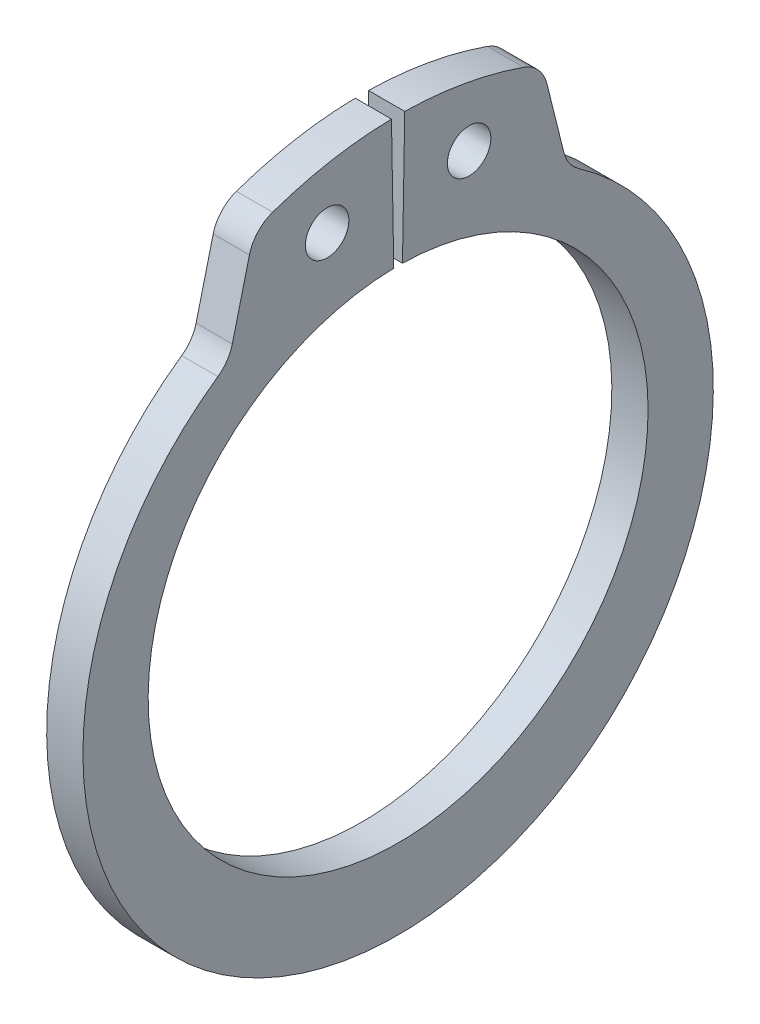
ISO-10303-21;
HEADER;
FILE_DESCRIPTION(('STEP AP214'),'2;1');
FILE_NAME('part.step','',(''),(''),'','','');
FILE_SCHEMA(('AUTOMOTIVE_DESIGN { 1 0 10303 214 1 1 1 1 }'));
ENDSEC;
DATA;
#1=APPLICATION_CONTEXT('core data for automotive mechanical design processes');
#2=APPLICATION_PROTOCOL_DEFINITION('international standard','automotive_design',2000,#1);
#3=PRODUCT_CONTEXT('',#1,'mechanical');
#4=PRODUCT('Part','Part','',(#3));
#5=PRODUCT_RELATED_PRODUCT_CATEGORY('part','',(#4));
#6=PRODUCT_DEFINITION_FORMATION('','',#4);
#7=PRODUCT_DEFINITION_CONTEXT('part definition',#1,'design');
#8=PRODUCT_DEFINITION('design','',#6,#7);
#9=PRODUCT_DEFINITION_SHAPE('','',#8);
#10=(LENGTH_UNIT() NAMED_UNIT(*) SI_UNIT(.MILLI.,.METRE.));
#11=(NAMED_UNIT(*) PLANE_ANGLE_UNIT() SI_UNIT($,.RADIAN.));
#12=(NAMED_UNIT(*) SI_UNIT($,.STERADIAN.) SOLID_ANGLE_UNIT());
#13=UNCERTAINTY_MEASURE_WITH_UNIT(LENGTH_MEASURE(1.E-05),#10,'distance_accuracy_value','');
#14=(GEOMETRIC_REPRESENTATION_CONTEXT(3) GLOBAL_UNCERTAINTY_ASSIGNED_CONTEXT((#13)) GLOBAL_UNIT_ASSIGNED_CONTEXT((#10,
#11,#12)) REPRESENTATION_CONTEXT('',''));
#15=CARTESIAN_POINT('',(0.,0.,0.));
#16=DIRECTION('',(0.,0.,1.));
#17=DIRECTION('',(1.,0.,0.));
#18=AXIS2_PLACEMENT_3D('',#15,#16,#17);
#19=CARTESIAN_POINT('',(0.5,0.,0.));
#20=DIRECTION('',(1.,0.,0.));
#21=DIRECTION('',(0.,0.,-1.));
#22=AXIS2_PLACEMENT_3D('',#19,#20,#21);
#23=PLANE('',#22);
#24=CARTESIAN_POINT('',(0.5,8.66711980549086,-1.9596288316201));
#25=DIRECTION('',(-1.,0.,0.));
#26=DIRECTION('',(0.,0.,1.));
#27=AXIS2_PLACEMENT_3D('',#24,#25,#26);
#28=CIRCLE('',#27,0.6);
#29=CARTESIAN_POINT('',(0.5,8.66711980549086,-1.3596288316201));
#30=VERTEX_POINT('',#29);
#31=EDGE_CURVE('E141',#30,#30,#28,.T.);
#32=ORIENTED_EDGE('',*,*,#31,.T.);
#33=EDGE_LOOP('',(#32));
#34=FACE_BOUND('',#33,.T.);
#35=CARTESIAN_POINT('',(0.5,0.,0.));
#36=DIRECTION('',(-1.,0.,0.));
#37=DIRECTION('',(0.,0.,1.));
#38=AXIS2_PLACEMENT_3D('',#35,#36,#37);
#39=CIRCLE('',#38,6.9);
#40=CARTESIAN_POINT('',(0.5,6.8989490965791,-0.120421604417256));
#41=VERTEX_POINT('',#40);
#42=CARTESIAN_POINT('',(0.5,6.8989490965791,0.120421604417256));
#43=VERTEX_POINT('',#42);
#44=EDGE_CURVE('E217',#41,#43,#39,.T.);
#45=ORIENTED_EDGE('',*,*,#44,.T.);
#46=DIRECTION('',(0.,-0.999847695156391,-0.0174524064372835));
#47=VECTOR('',#46,1.);
#48=CARTESIAN_POINT('',(0.5,6.8989490965791,0.120421604417256));
#49=LINE('',#48,#47);
#50=CARTESIAN_POINT('',(0.5,10.4984007991421,0.183250267591477));
#51=VERTEX_POINT('',#50);
#52=EDGE_CURVE('E157',#43,#51,#49,.F.);
#53=ORIENTED_EDGE('',*,*,#52,.T.);
#54=CARTESIAN_POINT('',(0.5,0.,0.));
#55=DIRECTION('',(-1.,0.,0.));
#56=DIRECTION('',(0.,0.,1.));
#57=AXIS2_PLACEMENT_3D('',#54,#55,#56);
#58=CIRCLE('',#57,10.5);
#59=CARTESIAN_POINT('',(0.5,9.91217887924345,3.46391539531209));
#60=VERTEX_POINT('',#59);
#61=EDGE_CURVE('E161',#60,#51,#58,.T.);
#62=ORIENTED_EDGE('',*,*,#61,.F.);
#63=CARTESIAN_POINT('',(0.5,8.96816184312502,3.13401869099666));
#64=DIRECTION('',(-1.,0.,0.));
#65=DIRECTION('',(0.,0.,1.));
#66=AXIS2_PLACEMENT_3D('',#63,#64,#65);
#67=CIRCLE('',#66,1.);
#68=CARTESIAN_POINT('',(0.5,9.21008373872469,4.10431441727265));
#69=VERTEX_POINT('',#68);
#70=EDGE_CURVE('E145',#69,#60,#67,.T.);
#71=ORIENTED_EDGE('',*,*,#70,.F.);
#72=DIRECTION('',(0.,0.970295726275997,-0.241921895599665));
#73=VECTOR('',#72,1.);
#74=CARTESIAN_POINT('',(0.5,9.71734472745919,3.97784004803122));
#75=LINE('',#74,#73);
#76=CARTESIAN_POINT('',(0.5,7.31761530924591,4.57615979123836));
#77=VERTEX_POINT('',#76);
#78=EDGE_CURVE('E139',#69,#77,#75,.F.);
#79=ORIENTED_EDGE('',*,*,#78,.T.);
#80=CARTESIAN_POINT('',(0.5,7.55953720484558,5.54645551751436));
#81=DIRECTION('',(-1.,0.,0.));
#82=DIRECTION('',(0.,0.,1.));
#83=AXIS2_PLACEMENT_3D('',#80,#81,#82);
#84=CIRCLE('',#83,1.);
#85=CARTESIAN_POINT('',(0.5,6.73911195964233,4.97470170945253));
#86=VERTEX_POINT('',#85);
#87=EDGE_CURVE('E129',#77,#86,#84,.T.);
#88=ORIENTED_EDGE('',*,*,#87,.T.);
#89=CARTESIAN_POINT('',(0.5,-0.399224177769538,0.));
#90=DIRECTION('',(-1.,0.,0.));
#91=DIRECTION('',(0.,0.,1.));
#92=AXIS2_PLACEMENT_3D('',#89,#90,#91);
#93=CIRCLE('',#92,8.70077582223046);
#94=CARTESIAN_POINT('',(0.5,6.73911195964233,-4.97470170945253));
#95=VERTEX_POINT('',#94);
#96=EDGE_CURVE('E231',#95,#86,#93,.T.);
#97=ORIENTED_EDGE('',*,*,#96,.F.);
#98=CARTESIAN_POINT('',(0.5,7.55953720484558,-5.54645551751436));
#99=DIRECTION('',(-1.,0.,0.));
#100=DIRECTION('',(0.,0.,1.));
#101=AXIS2_PLACEMENT_3D('',#98,#99,#100);
#102=CIRCLE('',#101,1.);
#103=CARTESIAN_POINT('',(0.5,7.31761530924591,-4.57615979123836));
#104=VERTEX_POINT('',#103);
#105=EDGE_CURVE('E227',#95,#104,#102,.T.);
#106=ORIENTED_EDGE('',*,*,#105,.T.);
#107=DIRECTION('',(0.,-0.970295726275997,-0.241921895599666));
#108=VECTOR('',#107,1.);
#109=CARTESIAN_POINT('',(0.5,9.71734472745919,-3.97784004803122));
#110=LINE('',#109,#108);
#111=CARTESIAN_POINT('',(0.5,9.21008373872469,-4.10431441727265));
#112=VERTEX_POINT('',#111);
#113=EDGE_CURVE('E169',#104,#112,#110,.F.);
#114=ORIENTED_EDGE('',*,*,#113,.T.);
#115=CARTESIAN_POINT('',(0.5,8.96816184312502,-3.13401869099666));
#116=DIRECTION('',(-1.,0.,0.));
#117=DIRECTION('',(0.,0.,1.));
#118=AXIS2_PLACEMENT_3D('',#115,#116,#117);
#119=CIRCLE('',#118,1.);
#120=CARTESIAN_POINT('',(0.5,9.91217887924345,-3.46391539531209));
#121=VERTEX_POINT('',#120);
#122=EDGE_CURVE('E172',#121,#112,#119,.T.);
#123=ORIENTED_EDGE('',*,*,#122,.F.);
#124=CARTESIAN_POINT('',(0.5,0.,0.));
#125=DIRECTION('',(-1.,0.,0.));
#126=DIRECTION('',(0.,0.,1.));
#127=AXIS2_PLACEMENT_3D('',#124,#125,#126);
#128=CIRCLE('',#127,10.5);
#129=CARTESIAN_POINT('',(0.5,10.4984007991421,-0.183250267591479));
#130=VERTEX_POINT('',#129);
#131=EDGE_CURVE('E220',#130,#121,#128,.T.);
#132=ORIENTED_EDGE('',*,*,#131,.F.);
#133=DIRECTION('',(0.,0.999847695156391,-0.0174524064372841));
#134=VECTOR('',#133,1.);
#135=CARTESIAN_POINT('',(0.5,10.4984007991421,-0.183250267591479));
#136=LINE('',#135,#134);
#137=EDGE_CURVE('E163',#130,#41,#136,.F.);
#138=ORIENTED_EDGE('',*,*,#137,.T.);
#139=EDGE_LOOP('',(#45,#53,#62,#71,#79,#88,#97,#106,#114,#123,#132,#138));
#140=FACE_BOUND('',#139,.T.);
#141=CARTESIAN_POINT('',(0.5,8.66711980549086,1.9596288316201));
#142=DIRECTION('',(-1.,0.,0.));
#143=DIRECTION('',(0.,0.,1.));
#144=AXIS2_PLACEMENT_3D('',#141,#142,#143);
#145=CIRCLE('',#144,0.6);
#146=CARTESIAN_POINT('',(0.5,8.66711980549086,2.5596288316201));
#147=VERTEX_POINT('',#146);
#148=EDGE_CURVE('E19',#147,#147,#145,.T.);
#149=ORIENTED_EDGE('',*,*,#148,.T.);
#150=EDGE_LOOP('',(#149));
#151=FACE_BOUND('',#150,.T.);
#152=ADVANCED_FACE('F16',(#34,#140,#151),#23,.T.);
#153=CARTESIAN_POINT('',(0.5,8.66711980549086,1.9596288316201));
#154=DIRECTION('',(-1.,0.,0.));
#155=DIRECTION('',(0.,0.,1.));
#156=AXIS2_PLACEMENT_3D('',#153,#154,#155);
#157=CYLINDRICAL_SURFACE('',#156,0.6);
#158=CARTESIAN_POINT('',(-0.5,8.66711980549086,1.9596288316201));
#159=DIRECTION('',(-1.,0.,0.));
#160=DIRECTION('',(0.,0.,1.));
#161=AXIS2_PLACEMENT_3D('',#158,#159,#160);
#162=CIRCLE('',#161,0.6);
#163=CARTESIAN_POINT('',(-0.5,8.66711980549086,2.5596288316201));
#164=VERTEX_POINT('',#163);
#165=EDGE_CURVE('E206',#164,#164,#162,.T.);
#166=ORIENTED_EDGE('',*,*,#165,.T.);
#167=EDGE_LOOP('',(#166));
#168=FACE_BOUND('',#167,.T.);
#169=ORIENTED_EDGE('',*,*,#148,.F.);
#170=EDGE_LOOP('',(#169));
#171=FACE_BOUND('',#170,.T.);
#172=ADVANCED_FACE('F437',(#168,#171),#157,.F.);
#173=CARTESIAN_POINT('',(0.5,7.55953720484558,5.54645551751436));
#174=DIRECTION('',(-1.,0.,0.));
#175=DIRECTION('',(0.,0.,1.));
#176=AXIS2_PLACEMENT_3D('',#173,#174,#175);
#177=CYLINDRICAL_SURFACE('',#176,1.);
#178=DIRECTION('',(1.,0.,0.));
#179=VECTOR('',#178,1.);
#180=CARTESIAN_POINT('',(0.5,7.31761530924591,4.57615979123836));
#181=LINE('',#180,#179);
#182=CARTESIAN_POINT('',(-0.5,7.31761530924591,4.57615979123836));
#183=VERTEX_POINT('',#182);
#184=EDGE_CURVE('E133',#77,#183,#181,.F.);
#185=ORIENTED_EDGE('',*,*,#184,.T.);
#186=CARTESIAN_POINT('',(-0.5,7.55953720484558,5.54645551751436));
#187=DIRECTION('',(-1.,0.,0.));
#188=DIRECTION('',(0.,0.,1.));
#189=AXIS2_PLACEMENT_3D('',#186,#187,#188);
#190=CIRCLE('',#189,1.);
#191=CARTESIAN_POINT('',(-0.5,6.73911195964233,4.97470170945253));
#192=VERTEX_POINT('',#191);
#193=EDGE_CURVE('E203',#183,#192,#190,.T.);
#194=ORIENTED_EDGE('',*,*,#193,.T.);
#195=DIRECTION('',(-1.,0.,0.));
#196=VECTOR('',#195,1.);
#197=CARTESIAN_POINT('',(0.5,6.73911195964233,4.97470170945253));
#198=LINE('',#197,#196);
#199=EDGE_CURVE('E134',#86,#192,#198,.T.);
#200=ORIENTED_EDGE('',*,*,#199,.F.);
#201=ORIENTED_EDGE('',*,*,#87,.F.);
#202=EDGE_LOOP('',(#185,#194,#200,#201));
#203=FACE_BOUND('',#202,.T.);
#204=ADVANCED_FACE('F131',(#203),#177,.F.);
#205=CARTESIAN_POINT('',(0.5,-0.399224177769538,0.));
#206=DIRECTION('',(-1.,0.,0.));
#207=DIRECTION('',(0.,0.,1.));
#208=AXIS2_PLACEMENT_3D('',#205,#206,#207);
#209=CYLINDRICAL_SURFACE('',#208,8.70077582223046);
#210=CARTESIAN_POINT('',(-0.5,-0.399224177769538,0.));
#211=DIRECTION('',(-1.,0.,0.));
#212=DIRECTION('',(0.,0.,1.));
#213=AXIS2_PLACEMENT_3D('',#210,#211,#212);
#214=CIRCLE('',#213,8.70077582223046);
#215=CARTESIAN_POINT('',(-0.5,6.73911195964233,-4.97470170945253));
#216=VERTEX_POINT('',#215);
#217=EDGE_CURVE('E200',#192,#216,#214,.F.);
#218=ORIENTED_EDGE('',*,*,#217,.T.);
#219=DIRECTION('',(-1.,0.,0.));
#220=VECTOR('',#219,1.);
#221=CARTESIAN_POINT('',(0.5,6.73911195964233,-4.97470170945253));
#222=LINE('',#221,#220);
#223=EDGE_CURVE('E230',#216,#95,#222,.F.);
#224=ORIENTED_EDGE('',*,*,#223,.T.);
#225=ORIENTED_EDGE('',*,*,#96,.T.);
#226=ORIENTED_EDGE('',*,*,#199,.T.);
#227=EDGE_LOOP('',(#218,#224,#225,#226));
#228=FACE_BOUND('',#227,.T.);
#229=ADVANCED_FACE('F239',(#228),#209,.T.);
#230=CARTESIAN_POINT('',(0.5,7.55953720484558,-5.54645551751436));
#231=DIRECTION('',(-1.,0.,0.));
#232=DIRECTION('',(0.,0.,1.));
#233=AXIS2_PLACEMENT_3D('',#230,#231,#232);
#234=CYLINDRICAL_SURFACE('',#233,1.);
#235=ORIENTED_EDGE('',*,*,#223,.F.);
#236=CARTESIAN_POINT('',(-0.5,7.55953720484558,-5.54645551751436));
#237=DIRECTION('',(-1.,0.,0.));
#238=DIRECTION('',(0.,0.,1.));
#239=AXIS2_PLACEMENT_3D('',#236,#237,#238);
#240=CIRCLE('',#239,1.);
#241=CARTESIAN_POINT('',(-0.5,7.31761530924591,-4.57615979123836));
#242=VERTEX_POINT('',#241);
#243=EDGE_CURVE('E196',#216,#242,#240,.T.);
#244=ORIENTED_EDGE('',*,*,#243,.T.);
#245=DIRECTION('',(1.,0.,0.));
#246=VECTOR('',#245,1.);
#247=CARTESIAN_POINT('',(0.5,7.31761530924591,-4.57615979123836));
#248=LINE('',#247,#246);
#249=EDGE_CURVE('E173',#242,#104,#248,.T.);
#250=ORIENTED_EDGE('',*,*,#249,.T.);
#251=ORIENTED_EDGE('',*,*,#105,.F.);
#252=EDGE_LOOP('',(#235,#244,#250,#251));
#253=FACE_BOUND('',#252,.T.);
#254=ADVANCED_FACE('F251',(#253),#234,.F.);
#255=CARTESIAN_POINT('',(0.5,9.71734472745919,-3.97784004803122));
#256=DIRECTION('',(0.,-0.241921895599666,0.970295726275997));
#257=DIRECTION('',(0.,-0.970295726275997,-0.241921895599666));
#258=AXIS2_PLACEMENT_3D('',#255,#256,#257);
#259=PLANE('',#258);
#260=DIRECTION('',(-1.,0.,0.));
#261=VECTOR('',#260,1.);
#262=CARTESIAN_POINT('',(0.5,9.21008373872469,-4.10431441727265));
#263=LINE('',#262,#261);
#264=CARTESIAN_POINT('',(-0.5,9.21008373872469,-4.10431441727265));
#265=VERTEX_POINT('',#264);
#266=EDGE_CURVE('E224',#112,#265,#263,.T.);
#267=ORIENTED_EDGE('',*,*,#266,.F.);
#268=ORIENTED_EDGE('',*,*,#113,.F.);
#269=ORIENTED_EDGE('',*,*,#249,.F.);
#270=DIRECTION('',(0.,0.970295726275997,0.241921895599666));
#271=VECTOR('',#270,1.);
#272=CARTESIAN_POINT('',(-0.5,7.31761530924591,-4.57615979123836));
#273=LINE('',#272,#271);
#274=EDGE_CURVE('E195',#242,#265,#273,.T.);
#275=ORIENTED_EDGE('',*,*,#274,.T.);
#276=EDGE_LOOP('',(#267,#268,#269,#275));
#277=FACE_BOUND('',#276,.T.);
#278=ADVANCED_FACE('F257',(#277),#259,.F.);
#279=CARTESIAN_POINT('',(0.5,8.96816184312502,-3.13401869099666));
#280=DIRECTION('',(-1.,0.,0.));
#281=DIRECTION('',(0.,0.,1.));
#282=AXIS2_PLACEMENT_3D('',#279,#280,#281);
#283=CYLINDRICAL_SURFACE('',#282,1.);
#284=CARTESIAN_POINT('',(-0.5,8.96816184312502,-3.13401869099666));
#285=DIRECTION('',(-1.,0.,0.));
#286=DIRECTION('',(0.,0.,1.));
#287=AXIS2_PLACEMENT_3D('',#284,#285,#286);
#288=CIRCLE('',#287,1.);
#289=CARTESIAN_POINT('',(-0.5,9.91217887924345,-3.46391539531209));
#290=VERTEX_POINT('',#289);
#291=EDGE_CURVE('E191',#265,#290,#288,.F.);
#292=ORIENTED_EDGE('',*,*,#291,.T.);
#293=DIRECTION('',(-1.,0.,0.));
#294=VECTOR('',#293,1.);
#295=CARTESIAN_POINT('',(0.5,9.91217887924345,-3.46391539531209));
#296=LINE('',#295,#294);
#297=EDGE_CURVE('E223',#121,#290,#296,.T.);
#298=ORIENTED_EDGE('',*,*,#297,.F.);
#299=ORIENTED_EDGE('',*,*,#122,.T.);
#300=ORIENTED_EDGE('',*,*,#266,.T.);
#301=EDGE_LOOP('',(#292,#298,#299,#300));
#302=FACE_BOUND('',#301,.T.);
#303=ADVANCED_FACE('F292',(#302),#283,.T.);
#304=CARTESIAN_POINT('',(0.5,0.,0.));
#305=DIRECTION('',(-1.,0.,0.));
#306=DIRECTION('',(0.,0.,1.));
#307=AXIS2_PLACEMENT_3D('',#304,#305,#306);
#308=CYLINDRICAL_SURFACE('',#307,10.5);
#309=CARTESIAN_POINT('',(-0.5,0.,0.));
#310=DIRECTION('',(-1.,0.,0.));
#311=DIRECTION('',(0.,0.,1.));
#312=AXIS2_PLACEMENT_3D('',#309,#310,#311);
#313=CIRCLE('',#312,10.5);
#314=CARTESIAN_POINT('',(-0.5,10.4984007991421,-0.183250267591479));
#315=VERTEX_POINT('',#314);
#316=EDGE_CURVE('E187',#290,#315,#313,.F.);
#317=ORIENTED_EDGE('',*,*,#316,.T.);
#318=DIRECTION('',(1.,0.,0.));
#319=VECTOR('',#318,1.);
#320=CARTESIAN_POINT('',(0.5,10.4984007991421,-0.183250267591479));
#321=LINE('',#320,#319);
#322=EDGE_CURVE('E168',#315,#130,#321,.T.);
#323=ORIENTED_EDGE('',*,*,#322,.T.);
#324=ORIENTED_EDGE('',*,*,#131,.T.);
#325=ORIENTED_EDGE('',*,*,#297,.T.);
#326=EDGE_LOOP('',(#317,#323,#324,#325));
#327=FACE_BOUND('',#326,.T.);
#328=ADVANCED_FACE('F288',(#327),#308,.T.);
#329=CARTESIAN_POINT('',(0.5,10.4984007991421,-0.183250267591479));
#330=DIRECTION('',(0.,-0.0174524064372841,-0.999847695156391));
#331=DIRECTION('',(0.,0.999847695156391,-0.0174524064372841));
#332=AXIS2_PLACEMENT_3D('',#329,#330,#331);
#333=PLANE('',#332);
#334=DIRECTION('',(-1.,0.,0.));
#335=VECTOR('',#334,1.);
#336=CARTESIAN_POINT('',(0.5,6.8989490965791,-0.120421604417256));
#337=LINE('',#336,#335);
#338=CARTESIAN_POINT('',(-0.5,6.8989490965791,-0.120421604417256));
#339=VERTEX_POINT('',#338);
#340=EDGE_CURVE('E167',#339,#41,#337,.F.);
#341=ORIENTED_EDGE('',*,*,#340,.T.);
#342=ORIENTED_EDGE('',*,*,#137,.F.);
#343=ORIENTED_EDGE('',*,*,#322,.F.);
#344=DIRECTION('',(0.,-0.999847695156391,0.017452406437284));
#345=VECTOR('',#344,1.);
#346=CARTESIAN_POINT('',(-0.5,10.4984007991421,-0.183250267591479));
#347=LINE('',#346,#345);
#348=EDGE_CURVE('E186',#315,#339,#347,.T.);
#349=ORIENTED_EDGE('',*,*,#348,.T.);
#350=EDGE_LOOP('',(#341,#342,#343,#349));
#351=FACE_BOUND('',#350,.T.);
#352=ADVANCED_FACE('F300',(#351),#333,.F.);
#353=CARTESIAN_POINT('',(0.5,0.,0.));
#354=DIRECTION('',(-1.,0.,0.));
#355=DIRECTION('',(0.,0.,1.));
#356=AXIS2_PLACEMENT_3D('',#353,#354,#355);
#357=CYLINDRICAL_SURFACE('',#356,6.9);
#358=ORIENTED_EDGE('',*,*,#44,.F.);
#359=ORIENTED_EDGE('',*,*,#340,.F.);
#360=CARTESIAN_POINT('',(-0.5,0.,0.));
#361=DIRECTION('',(-1.,0.,0.));
#362=DIRECTION('',(0.,0.,1.));
#363=AXIS2_PLACEMENT_3D('',#360,#361,#362);
#364=CIRCLE('',#363,6.9);
#365=CARTESIAN_POINT('',(-0.5,6.8989490965791,0.120421604417256));
#366=VERTEX_POINT('',#365);
#367=EDGE_CURVE('E183',#339,#366,#364,.T.);
#368=ORIENTED_EDGE('',*,*,#367,.T.);
#369=DIRECTION('',(1.,0.,0.));
#370=VECTOR('',#369,1.);
#371=CARTESIAN_POINT('',(0.5,6.8989490965791,0.120421604417256));
#372=LINE('',#371,#370);
#373=EDGE_CURVE('E162',#366,#43,#372,.T.);
#374=ORIENTED_EDGE('',*,*,#373,.T.);
#375=EDGE_LOOP('',(#358,#359,#368,#374));
#376=FACE_BOUND('',#375,.T.);
#377=ADVANCED_FACE('F327',(#376),#357,.F.);
#378=CARTESIAN_POINT('',(0.5,6.8989490965791,0.120421604417256));
#379=DIRECTION('',(0.,-0.0174524064372835,0.999847695156391));
#380=DIRECTION('',(0.,-0.999847695156391,-0.0174524064372835));
#381=AXIS2_PLACEMENT_3D('',#378,#379,#380);
#382=PLANE('',#381);
#383=DIRECTION('',(-1.,0.,0.));
#384=VECTOR('',#383,1.);
#385=CARTESIAN_POINT('',(0.5,10.4984007991421,0.183250267591476));
#386=LINE('',#385,#384);
#387=CARTESIAN_POINT('',(-0.5,10.4984007991421,0.183250267591477));
#388=VERTEX_POINT('',#387);
#389=EDGE_CURVE('E214',#51,#388,#386,.T.);
#390=ORIENTED_EDGE('',*,*,#389,.F.);
#391=ORIENTED_EDGE('',*,*,#52,.F.);
#392=ORIENTED_EDGE('',*,*,#373,.F.);
#393=DIRECTION('',(0.,0.999847695156391,0.0174524064372835));
#394=VECTOR('',#393,1.);
#395=CARTESIAN_POINT('',(-0.5,6.8989490965791,0.120421604417256));
#396=LINE('',#395,#394);
#397=EDGE_CURVE('E182',#366,#388,#396,.T.);
#398=ORIENTED_EDGE('',*,*,#397,.T.);
#399=EDGE_LOOP('',(#390,#391,#392,#398));
#400=FACE_BOUND('',#399,.T.);
#401=ADVANCED_FACE('F323',(#400),#382,.F.);
#402=CARTESIAN_POINT('',(0.5,0.,0.));
#403=DIRECTION('',(-1.,0.,0.));
#404=DIRECTION('',(0.,0.,1.));
#405=AXIS2_PLACEMENT_3D('',#402,#403,#404);
#406=CYLINDRICAL_SURFACE('',#405,10.5);
#407=ORIENTED_EDGE('',*,*,#61,.T.);
#408=ORIENTED_EDGE('',*,*,#389,.T.);
#409=CARTESIAN_POINT('',(-0.5,0.,0.));
#410=DIRECTION('',(-1.,0.,0.));
#411=DIRECTION('',(0.,0.,1.));
#412=AXIS2_PLACEMENT_3D('',#409,#410,#411);
#413=CIRCLE('',#412,10.5);
#414=CARTESIAN_POINT('',(-0.5,9.91217887924345,3.46391539531209));
#415=VERTEX_POINT('',#414);
#416=EDGE_CURVE('E178',#388,#415,#413,.F.);
#417=ORIENTED_EDGE('',*,*,#416,.T.);
#418=DIRECTION('',(-1.,0.,0.));
#419=VECTOR('',#418,1.);
#420=CARTESIAN_POINT('',(0.5,9.91217887924345,3.46391539531209));
#421=LINE('',#420,#419);
#422=EDGE_CURVE('E152',#60,#415,#421,.T.);
#423=ORIENTED_EDGE('',*,*,#422,.F.);
#424=EDGE_LOOP('',(#407,#408,#417,#423));
#425=FACE_BOUND('',#424,.T.);
#426=ADVANCED_FACE('F320',(#425),#406,.T.);
#427=CARTESIAN_POINT('',(0.5,8.96816184312502,3.13401869099666));
#428=DIRECTION('',(-1.,0.,0.));
#429=DIRECTION('',(0.,0.,1.));
#430=AXIS2_PLACEMENT_3D('',#427,#428,#429);
#431=CYLINDRICAL_SURFACE('',#430,1.);
#432=CARTESIAN_POINT('',(-0.5,8.96816184312502,3.13401869099666));
#433=DIRECTION('',(-1.,0.,0.));
#434=DIRECTION('',(0.,0.,1.));
#435=AXIS2_PLACEMENT_3D('',#432,#433,#434);
#436=CIRCLE('',#435,1.);
#437=CARTESIAN_POINT('',(-0.5,9.21008373872469,4.10431441727265));
#438=VERTEX_POINT('',#437);
#439=EDGE_CURVE('E175',#415,#438,#436,.F.);
#440=ORIENTED_EDGE('',*,*,#439,.T.);
#441=DIRECTION('',(1.,0.,0.));
#442=VECTOR('',#441,1.);
#443=CARTESIAN_POINT('',(0.5,9.21008373872469,4.10431441727265));
#444=LINE('',#443,#442);
#445=EDGE_CURVE('E39',#438,#69,#444,.T.);
#446=ORIENTED_EDGE('',*,*,#445,.T.);
#447=ORIENTED_EDGE('',*,*,#70,.T.);
#448=ORIENTED_EDGE('',*,*,#422,.T.);
#449=EDGE_LOOP('',(#440,#446,#447,#448));
#450=FACE_BOUND('',#449,.T.);
#451=ADVANCED_FACE('F317',(#450),#431,.T.);
#452=CARTESIAN_POINT('',(0.5,9.71734472745919,3.97784004803122));
#453=DIRECTION('',(0.,-0.241921895599665,-0.970295726275997));
#454=DIRECTION('',(0.,0.970295726275997,-0.241921895599665));
#455=AXIS2_PLACEMENT_3D('',#452,#453,#454);
#456=PLANE('',#455);
#457=ORIENTED_EDGE('',*,*,#184,.F.);
#458=ORIENTED_EDGE('',*,*,#78,.F.);
#459=ORIENTED_EDGE('',*,*,#445,.F.);
#460=DIRECTION('',(0.,-0.970295726275997,0.241921895599665));
#461=VECTOR('',#460,1.);
#462=CARTESIAN_POINT('',(-0.5,9.21008373872469,4.10431441727265));
#463=LINE('',#462,#461);
#464=EDGE_CURVE('E26',#438,#183,#463,.T.);
#465=ORIENTED_EDGE('',*,*,#464,.T.);
#466=EDGE_LOOP('',(#457,#458,#459,#465));
#467=FACE_BOUND('',#466,.T.);
#468=ADVANCED_FACE('F138',(#467),#456,.F.);
#469=CARTESIAN_POINT('',(0.5,8.66711980549086,-1.9596288316201));
#470=DIRECTION('',(-1.,0.,0.));
#471=DIRECTION('',(0.,0.,1.));
#472=AXIS2_PLACEMENT_3D('',#469,#470,#471);
#473=CYLINDRICAL_SURFACE('',#472,0.6);
#474=CARTESIAN_POINT('',(-0.5,8.66711980549086,-1.9596288316201));
#475=DIRECTION('',(-1.,0.,0.));
#476=DIRECTION('',(0.,0.,1.));
#477=AXIS2_PLACEMENT_3D('',#474,#475,#476);
#478=CIRCLE('',#477,0.6);
#479=CARTESIAN_POINT('',(-0.5,8.66711980549086,-1.3596288316201));
#480=VERTEX_POINT('',#479);
#481=EDGE_CURVE('E11',#480,#480,#478,.T.);
#482=ORIENTED_EDGE('',*,*,#481,.T.);
#483=EDGE_LOOP('',(#482));
#484=FACE_BOUND('',#483,.T.);
#485=ORIENTED_EDGE('',*,*,#31,.F.);
#486=EDGE_LOOP('',(#485));
#487=FACE_BOUND('',#486,.T.);
#488=ADVANCED_FACE('F304',(#484,#487),#473,.F.);
#489=CARTESIAN_POINT('',(-0.5,0.,0.));
#490=DIRECTION('',(1.,0.,0.));
#491=DIRECTION('',(0.,0.,-1.));
#492=AXIS2_PLACEMENT_3D('',#489,#490,#491);
#493=PLANE('',#492);
#494=ORIENTED_EDGE('',*,*,#481,.F.);
#495=EDGE_LOOP('',(#494));
#496=FACE_BOUND('',#495,.T.);
#497=ORIENTED_EDGE('',*,*,#439,.F.);
#498=ORIENTED_EDGE('',*,*,#416,.F.);
#499=ORIENTED_EDGE('',*,*,#397,.F.);
#500=ORIENTED_EDGE('',*,*,#367,.F.);
#501=ORIENTED_EDGE('',*,*,#348,.F.);
#502=ORIENTED_EDGE('',*,*,#316,.F.);
#503=ORIENTED_EDGE('',*,*,#291,.F.);
#504=ORIENTED_EDGE('',*,*,#274,.F.);
#505=ORIENTED_EDGE('',*,*,#243,.F.);
#506=ORIENTED_EDGE('',*,*,#217,.F.);
#507=ORIENTED_EDGE('',*,*,#193,.F.);
#508=ORIENTED_EDGE('',*,*,#464,.F.);
#509=EDGE_LOOP('',(#497,#498,#499,#500,#501,#502,#503,#504,#505,#506,#507,#508));
#510=FACE_BOUND('',#509,.T.);
#511=ORIENTED_EDGE('',*,*,#165,.F.);
#512=EDGE_LOOP('',(#511));
#513=FACE_BOUND('',#512,.T.);
#514=ADVANCED_FACE('F244',(#496,#510,#513),#493,.F.);
#515=CLOSED_SHELL('',(#152,#172,#204,#229,#254,#278,#303,#328,#352,#377,#401,#426,#451,#468,
#488,#514));
#516=MANIFOLD_SOLID_BREP('B1',#515);
#517=ADVANCED_BREP_SHAPE_REPRESENTATION('',(#18,#516),#14);
#518=SHAPE_DEFINITION_REPRESENTATION(#9,#517);
ENDSEC;
END-ISO-10303-21;
